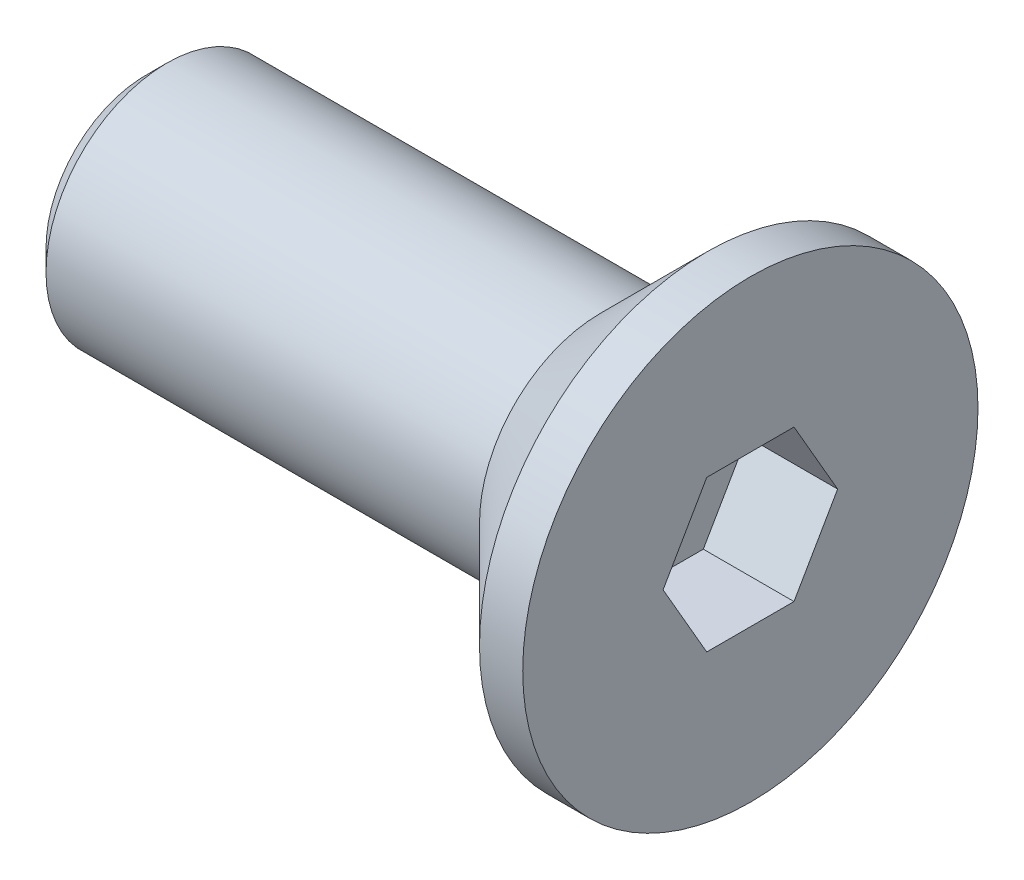
ISO-10303-21;
HEADER;
FILE_DESCRIPTION(('STEP AP214'),'2;1');
FILE_NAME('part.step','',(''),(''),'','','');
FILE_SCHEMA(('AUTOMOTIVE_DESIGN { 1 0 10303 214 1 1 1 1 }'));
ENDSEC;
DATA;
#1=APPLICATION_CONTEXT('core data for automotive mechanical design processes');
#2=APPLICATION_PROTOCOL_DEFINITION('international standard','automotive_design',2000,#1);
#3=PRODUCT_CONTEXT('',#1,'mechanical');
#4=PRODUCT('Part','Part','',(#3));
#5=PRODUCT_RELATED_PRODUCT_CATEGORY('part','',(#4));
#6=PRODUCT_DEFINITION_FORMATION('','',#4);
#7=PRODUCT_DEFINITION_CONTEXT('part definition',#1,'design');
#8=PRODUCT_DEFINITION('design','',#6,#7);
#9=PRODUCT_DEFINITION_SHAPE('','',#8);
#10=(LENGTH_UNIT() NAMED_UNIT(*) SI_UNIT(.MILLI.,.METRE.));
#11=(NAMED_UNIT(*) PLANE_ANGLE_UNIT() SI_UNIT($,.RADIAN.));
#12=(NAMED_UNIT(*) SI_UNIT($,.STERADIAN.) SOLID_ANGLE_UNIT());
#13=UNCERTAINTY_MEASURE_WITH_UNIT(LENGTH_MEASURE(1.E-05),#10,'distance_accuracy_value','');
#14=(GEOMETRIC_REPRESENTATION_CONTEXT(3) GLOBAL_UNCERTAINTY_ASSIGNED_CONTEXT((#13)) GLOBAL_UNIT_ASSIGNED_CONTEXT((#10,
#11,#12)) REPRESENTATION_CONTEXT('',''));
#15=CARTESIAN_POINT('',(0.,0.,0.));
#16=DIRECTION('',(0.,0.,1.));
#17=DIRECTION('',(1.,0.,0.));
#18=AXIS2_PLACEMENT_3D('',#15,#16,#17);
#19=CARTESIAN_POINT('',(0.,0.,0.));
#20=DIRECTION('',(1.,0.,0.));
#21=DIRECTION('',(0.,1.,0.));
#22=AXIS2_PLACEMENT_3D('',#19,#20,#21);
#23=PLANE('',#22);
#24=DIRECTION('',(0.,0.866025403784439,-0.5));
#25=VECTOR('',#24,1.);
#26=CARTESIAN_POINT('',(0.,-1.25,-0.721687836487034));
#27=LINE('',#26,#25);
#28=CARTESIAN_POINT('',(0.,-1.25,-0.721687836487034));
#29=VERTEX_POINT('',#28);
#30=CARTESIAN_POINT('',(0.,0.,-1.44337567297406));
#31=VERTEX_POINT('',#30);
#32=EDGE_CURVE('E31',#29,#31,#27,.T.);
#33=ORIENTED_EDGE('',*,*,#32,.F.);
#34=DIRECTION('',(0.,0.,-1.));
#35=VECTOR('',#34,1.);
#36=CARTESIAN_POINT('',(0.,-1.25,0.721687836487033));
#37=LINE('',#36,#35);
#38=CARTESIAN_POINT('',(0.,-1.25,0.721687836487033));
#39=VERTEX_POINT('',#38);
#40=EDGE_CURVE('E114',#39,#29,#37,.T.);
#41=ORIENTED_EDGE('',*,*,#40,.F.);
#42=DIRECTION('',(0.,-0.866025403784439,-0.5));
#43=VECTOR('',#42,1.);
#44=CARTESIAN_POINT('',(0.,0.,1.44337567297406));
#45=LINE('',#44,#43);
#46=CARTESIAN_POINT('',(0.,0.,1.44337567297406));
#47=VERTEX_POINT('',#46);
#48=EDGE_CURVE('E112',#47,#39,#45,.T.);
#49=ORIENTED_EDGE('',*,*,#48,.F.);
#50=DIRECTION('',(0.,-0.866025403784439,0.5));
#51=VECTOR('',#50,1.);
#52=CARTESIAN_POINT('',(0.,1.25,0.721687836487032));
#53=LINE('',#52,#51);
#54=CARTESIAN_POINT('',(0.,1.25,0.721687836487032));
#55=VERTEX_POINT('',#54);
#56=EDGE_CURVE('E79',#55,#47,#53,.T.);
#57=ORIENTED_EDGE('',*,*,#56,.F.);
#58=DIRECTION('',(0.,0.,1.));
#59=VECTOR('',#58,1.);
#60=CARTESIAN_POINT('',(0.,1.25,-0.721687836487032));
#61=LINE('',#60,#59);
#62=CARTESIAN_POINT('',(0.,1.25,-0.721687836487032));
#63=VERTEX_POINT('',#62);
#64=EDGE_CURVE('E108',#63,#55,#61,.T.);
#65=ORIENTED_EDGE('',*,*,#64,.F.);
#66=DIRECTION('',(0.,0.866025403784439,0.5));
#67=VECTOR('',#66,1.);
#68=CARTESIAN_POINT('',(0.,0.,-1.44337567297406));
#69=LINE('',#68,#67);
#70=EDGE_CURVE('E105',#31,#63,#69,.T.);
#71=ORIENTED_EDGE('',*,*,#70,.F.);
#72=EDGE_LOOP('',(#33,#41,#49,#57,#65,#71));
#73=FACE_BOUND('',#72,.T.);
#74=CARTESIAN_POINT('',(0.,0.,0.));
#75=DIRECTION('',(1.,0.,0.));
#76=DIRECTION('',(0.,1.,0.));
#77=AXIS2_PLACEMENT_3D('',#74,#75,#76);
#78=CIRCLE('',#77,3.765);
#79=CARTESIAN_POINT('',(0.,3.765,0.));
#80=VERTEX_POINT('',#79);
#81=EDGE_CURVE('E129',#80,#80,#78,.T.);
#82=ORIENTED_EDGE('',*,*,#81,.T.);
#83=EDGE_LOOP('',(#82));
#84=FACE_BOUND('',#83,.T.);
#85=ADVANCED_FACE('F16',(#73,#84),#23,.T.);
#86=CARTESIAN_POINT('',(0.,0.,0.));
#87=DIRECTION('',(1.,0.,0.));
#88=DIRECTION('',(0.,1.,0.));
#89=AXIS2_PLACEMENT_3D('',#86,#87,#88);
#90=CYLINDRICAL_SURFACE('',#89,3.765);
#91=CARTESIAN_POINT('',(-0.715,0.,0.));
#92=DIRECTION('',(1.,0.,0.));
#93=DIRECTION('',(0.,1.,0.));
#94=AXIS2_PLACEMENT_3D('',#91,#92,#93);
#95=CIRCLE('',#94,3.765);
#96=CARTESIAN_POINT('',(-0.715000000000001,3.765,0.));
#97=VERTEX_POINT('',#96);
#98=EDGE_CURVE('E126',#97,#97,#95,.T.);
#99=ORIENTED_EDGE('',*,*,#98,.T.);
#100=EDGE_LOOP('',(#99));
#101=FACE_BOUND('',#100,.T.);
#102=ORIENTED_EDGE('',*,*,#81,.F.);
#103=EDGE_LOOP('',(#102));
#104=FACE_BOUND('',#103,.T.);
#105=ADVANCED_FACE('F148',(#101,#104),#90,.T.);
#106=CARTESIAN_POINT('',(-0.715,0.,0.));
#107=DIRECTION('',(1.,0.,0.));
#108=DIRECTION('',(0.,1.,0.));
#109=AXIS2_PLACEMENT_3D('',#106,#107,#108);
#110=CONICAL_SURFACE('',#109,3.765,0.78539816339745);
#111=CARTESIAN_POINT('',(-2.48,0.,0.));
#112=DIRECTION('',(1.,0.,0.));
#113=DIRECTION('',(0.,1.,0.));
#114=AXIS2_PLACEMENT_3D('',#111,#112,#113);
#115=CIRCLE('',#114,2.);
#116=CARTESIAN_POINT('',(-2.48,2.,0.));
#117=VERTEX_POINT('',#116);
#118=EDGE_CURVE('E118',#117,#117,#115,.T.);
#119=ORIENTED_EDGE('',*,*,#118,.T.);
#120=EDGE_LOOP('',(#119));
#121=FACE_BOUND('',#120,.T.);
#122=ORIENTED_EDGE('',*,*,#98,.F.);
#123=EDGE_LOOP('',(#122));
#124=FACE_BOUND('',#123,.T.);
#125=ADVANCED_FACE('F154',(#121,#124),#110,.T.);
#126=CARTESIAN_POINT('',(0.,0.,0.));
#127=DIRECTION('',(1.,0.,0.));
#128=DIRECTION('',(0.,1.,0.));
#129=AXIS2_PLACEMENT_3D('',#126,#127,#128);
#130=CYLINDRICAL_SURFACE('',#129,2.);
#131=CARTESIAN_POINT('',(-9.65,0.,0.));
#132=DIRECTION('',(-1.,0.,0.));
#133=DIRECTION('',(0.,-1.,0.));
#134=AXIS2_PLACEMENT_3D('',#131,#132,#133);
#135=CIRCLE('',#134,2.);
#136=CARTESIAN_POINT('',(-9.65,-2.,0.));
#137=VERTEX_POINT('',#136);
#138=EDGE_CURVE('E24',#137,#137,#135,.F.);
#139=ORIENTED_EDGE('',*,*,#138,.T.);
#140=EDGE_LOOP('',(#139));
#141=FACE_BOUND('',#140,.T.);
#142=ORIENTED_EDGE('',*,*,#118,.F.);
#143=EDGE_LOOP('',(#142));
#144=FACE_BOUND('',#143,.T.);
#145=ADVANCED_FACE('F134',(#141,#144),#130,.T.);
#146=CARTESIAN_POINT('',(-10.,2.,0.));
#147=DIRECTION('',(-1.,0.,0.));
#148=DIRECTION('',(0.,-1.,0.));
#149=AXIS2_PLACEMENT_3D('',#146,#147,#148);
#150=PLANE('',#149);
#151=CARTESIAN_POINT('',(-10.,0.,0.));
#152=DIRECTION('',(-1.,0.,0.));
#153=DIRECTION('',(0.,-1.,0.));
#154=AXIS2_PLACEMENT_3D('',#151,#152,#153);
#155=CIRCLE('',#154,1.65);
#156=CARTESIAN_POINT('',(-10.,-1.65,0.));
#157=VERTEX_POINT('',#156);
#158=EDGE_CURVE('E10',#157,#157,#155,.T.);
#159=ORIENTED_EDGE('',*,*,#158,.T.);
#160=EDGE_LOOP('',(#159));
#161=FACE_BOUND('',#160,.T.);
#162=ADVANCED_FACE('F164',(#161),#150,.T.);
#163=CARTESIAN_POINT('',(-1.5,-1.25,-0.721687836487034));
#164=DIRECTION('',(0.,-0.5,-0.866025403784439));
#165=DIRECTION('',(0.,0.866025403784439,-0.5));
#166=AXIS2_PLACEMENT_3D('',#163,#164,#165);
#167=PLANE('',#166);
#168=ORIENTED_EDGE('',*,*,#32,.T.);
#169=DIRECTION('',(1.,0.,0.));
#170=VECTOR('',#169,1.);
#171=CARTESIAN_POINT('',(-1.5,0.,-1.44337567297406));
#172=LINE('',#171,#170);
#173=CARTESIAN_POINT('',(-1.5,0.,-1.44337567297406));
#174=VERTEX_POINT('',#173);
#175=EDGE_CURVE('E61',#174,#31,#172,.T.);
#176=ORIENTED_EDGE('',*,*,#175,.F.);
#177=DIRECTION('',(0.,0.866025403784439,-0.5));
#178=VECTOR('',#177,1.);
#179=CARTESIAN_POINT('',(-1.5,-1.25,-0.721687836487034));
#180=LINE('',#179,#178);
#181=CARTESIAN_POINT('',(-1.5,-1.25,-0.721687836487034));
#182=VERTEX_POINT('',#181);
#183=EDGE_CURVE('E116',#182,#174,#180,.T.);
#184=ORIENTED_EDGE('',*,*,#183,.F.);
#185=DIRECTION('',(1.,0.,0.));
#186=VECTOR('',#185,1.);
#187=CARTESIAN_POINT('',(-1.5,-1.25,-0.721687836487034));
#188=LINE('',#187,#186);
#189=EDGE_CURVE('E39',#182,#29,#188,.T.);
#190=ORIENTED_EDGE('',*,*,#189,.T.);
#191=EDGE_LOOP('',(#168,#176,#184,#190));
#192=FACE_BOUND('',#191,.T.);
#193=ADVANCED_FACE('F167',(#192),#167,.F.);
#194=CARTESIAN_POINT('',(-1.5,-1.25,0.721687836487033));
#195=DIRECTION('',(0.,-1.,0.));
#196=DIRECTION('',(1.,0.,0.));
#197=AXIS2_PLACEMENT_3D('',#194,#195,#196);
#198=PLANE('',#197);
#199=ORIENTED_EDGE('',*,*,#40,.T.);
#200=ORIENTED_EDGE('',*,*,#189,.F.);
#201=DIRECTION('',(0.,0.,-1.));
#202=VECTOR('',#201,1.);
#203=CARTESIAN_POINT('',(-1.5,-1.25,0.721687836487033));
#204=LINE('',#203,#202);
#205=CARTESIAN_POINT('',(-1.5,-1.25,0.721687836487033));
#206=VERTEX_POINT('',#205);
#207=EDGE_CURVE('E91',#206,#182,#204,.T.);
#208=ORIENTED_EDGE('',*,*,#207,.F.);
#209=DIRECTION('',(1.,0.,0.));
#210=VECTOR('',#209,1.);
#211=CARTESIAN_POINT('',(-1.5,-1.25,0.721687836487033));
#212=LINE('',#211,#210);
#213=EDGE_CURVE('E83',#206,#39,#212,.T.);
#214=ORIENTED_EDGE('',*,*,#213,.T.);
#215=EDGE_LOOP('',(#199,#200,#208,#214));
#216=FACE_BOUND('',#215,.T.);
#217=ADVANCED_FACE('F171',(#216),#198,.F.);
#218=CARTESIAN_POINT('',(-1.5,0.,1.44337567297406));
#219=DIRECTION('',(0.,-0.5,0.866025403784438));
#220=DIRECTION('',(0.,-0.866025403784439,-0.5));
#221=AXIS2_PLACEMENT_3D('',#218,#219,#220);
#222=PLANE('',#221);
#223=ORIENTED_EDGE('',*,*,#48,.T.);
#224=ORIENTED_EDGE('',*,*,#213,.F.);
#225=DIRECTION('',(0.,-0.866025403784439,-0.5));
#226=VECTOR('',#225,1.);
#227=CARTESIAN_POINT('',(-1.5,0.,1.44337567297406));
#228=LINE('',#227,#226);
#229=CARTESIAN_POINT('',(-1.5,0.,1.44337567297406));
#230=VERTEX_POINT('',#229);
#231=EDGE_CURVE('E87',#230,#206,#228,.T.);
#232=ORIENTED_EDGE('',*,*,#231,.F.);
#233=DIRECTION('',(1.,0.,0.));
#234=VECTOR('',#233,1.);
#235=CARTESIAN_POINT('',(-1.5,0.,1.44337567297406));
#236=LINE('',#235,#234);
#237=EDGE_CURVE('E72',#230,#47,#236,.T.);
#238=ORIENTED_EDGE('',*,*,#237,.T.);
#239=EDGE_LOOP('',(#223,#224,#232,#238));
#240=FACE_BOUND('',#239,.T.);
#241=ADVANCED_FACE('F88',(#240),#222,.F.);
#242=CARTESIAN_POINT('',(-1.5,1.25,0.721687836487032));
#243=DIRECTION('',(0.,0.5,0.866025403784438));
#244=DIRECTION('',(0.,-0.866025403784439,0.5));
#245=AXIS2_PLACEMENT_3D('',#242,#243,#244);
#246=PLANE('',#245);
#247=ORIENTED_EDGE('',*,*,#56,.T.);
#248=ORIENTED_EDGE('',*,*,#237,.F.);
#249=DIRECTION('',(0.,-0.866025403784439,0.5));
#250=VECTOR('',#249,1.);
#251=CARTESIAN_POINT('',(-1.5,1.25,0.721687836487032));
#252=LINE('',#251,#250);
#253=CARTESIAN_POINT('',(-1.5,1.25,0.721687836487032));
#254=VERTEX_POINT('',#253);
#255=EDGE_CURVE('E76',#254,#230,#252,.T.);
#256=ORIENTED_EDGE('',*,*,#255,.F.);
#257=DIRECTION('',(1.,0.,0.));
#258=VECTOR('',#257,1.);
#259=CARTESIAN_POINT('',(-1.5,1.25,0.721687836487032));
#260=LINE('',#259,#258);
#261=EDGE_CURVE('E84',#254,#55,#260,.T.);
#262=ORIENTED_EDGE('',*,*,#261,.T.);
#263=EDGE_LOOP('',(#247,#248,#256,#262));
#264=FACE_BOUND('',#263,.T.);
#265=ADVANCED_FACE('F74',(#264),#246,.F.);
#266=CARTESIAN_POINT('',(-1.5,1.25,-0.721687836487032));
#267=DIRECTION('',(0.,1.,0.));
#268=DIRECTION('',(0.,0.,1.));
#269=AXIS2_PLACEMENT_3D('',#266,#267,#268);
#270=PLANE('',#269);
#271=ORIENTED_EDGE('',*,*,#64,.T.);
#272=ORIENTED_EDGE('',*,*,#261,.F.);
#273=DIRECTION('',(0.,0.,1.));
#274=VECTOR('',#273,1.);
#275=CARTESIAN_POINT('',(-1.5,1.25,-0.721687836487032));
#276=LINE('',#275,#274);
#277=CARTESIAN_POINT('',(-1.5,1.25,-0.721687836487032));
#278=VERTEX_POINT('',#277);
#279=EDGE_CURVE('E97',#278,#254,#276,.T.);
#280=ORIENTED_EDGE('',*,*,#279,.F.);
#281=DIRECTION('',(1.,0.,0.));
#282=VECTOR('',#281,1.);
#283=CARTESIAN_POINT('',(-1.5,1.25,-0.721687836487032));
#284=LINE('',#283,#282);
#285=EDGE_CURVE('E121',#278,#63,#284,.T.);
#286=ORIENTED_EDGE('',*,*,#285,.T.);
#287=EDGE_LOOP('',(#271,#272,#280,#286));
#288=FACE_BOUND('',#287,.T.);
#289=ADVANCED_FACE('F174',(#288),#270,.F.);
#290=CARTESIAN_POINT('',(-1.5,0.,-1.44337567297406));
#291=DIRECTION('',(0.,0.5,-0.866025403784439));
#292=DIRECTION('',(0.,0.866025403784439,0.5));
#293=AXIS2_PLACEMENT_3D('',#290,#291,#292);
#294=PLANE('',#293);
#295=ORIENTED_EDGE('',*,*,#70,.T.);
#296=ORIENTED_EDGE('',*,*,#285,.F.);
#297=DIRECTION('',(0.,0.866025403784439,0.5));
#298=VECTOR('',#297,1.);
#299=CARTESIAN_POINT('',(-1.5,0.,-1.44337567297406));
#300=LINE('',#299,#298);
#301=EDGE_CURVE('E99',#174,#278,#300,.T.);
#302=ORIENTED_EDGE('',*,*,#301,.F.);
#303=ORIENTED_EDGE('',*,*,#175,.T.);
#304=EDGE_LOOP('',(#295,#296,#302,#303));
#305=FACE_BOUND('',#304,.T.);
#306=ADVANCED_FACE('F144',(#305),#294,.F.);
#307=CARTESIAN_POINT('',(-1.5,0.,-1.44337567297406));
#308=DIRECTION('',(1.,0.,0.));
#309=DIRECTION('',(0.,1.,0.));
#310=AXIS2_PLACEMENT_3D('',#307,#308,#309);
#311=PLANE('',#310);
#312=ORIENTED_EDGE('',*,*,#183,.T.);
#313=ORIENTED_EDGE('',*,*,#301,.T.);
#314=ORIENTED_EDGE('',*,*,#279,.T.);
#315=ORIENTED_EDGE('',*,*,#255,.T.);
#316=ORIENTED_EDGE('',*,*,#231,.T.);
#317=ORIENTED_EDGE('',*,*,#207,.T.);
#318=EDGE_LOOP('',(#312,#313,#314,#315,#316,#317));
#319=FACE_BOUND('',#318,.T.);
#320=ADVANCED_FACE('F94',(#319),#311,.T.);
#321=CARTESIAN_POINT('',(-9.65,0.,0.));
#322=DIRECTION('',(1.,0.,0.));
#323=DIRECTION('',(0.,1.,0.));
#324=AXIS2_PLACEMENT_3D('',#321,#322,#323);
#325=CONICAL_SURFACE('',#324,2.,0.785398163397452);
#326=ORIENTED_EDGE('',*,*,#158,.F.);
#327=EDGE_LOOP('',(#326));
#328=FACE_BOUND('',#327,.T.);
#329=ORIENTED_EDGE('',*,*,#138,.F.);
#330=EDGE_LOOP('',(#329));
#331=FACE_BOUND('',#330,.T.);
#332=ADVANCED_FACE('F18',(#328,#331),#325,.T.);
#333=CLOSED_SHELL('',(#85,#105,#125,#145,#162,#193,#217,#241,#265,#289,#306,#320,#332));
#334=MANIFOLD_SOLID_BREP('B1',#333);
#335=ADVANCED_BREP_SHAPE_REPRESENTATION('',(#18,#334),#14);
#336=SHAPE_DEFINITION_REPRESENTATION(#9,#335);
ENDSEC;
END-ISO-10303-21;
